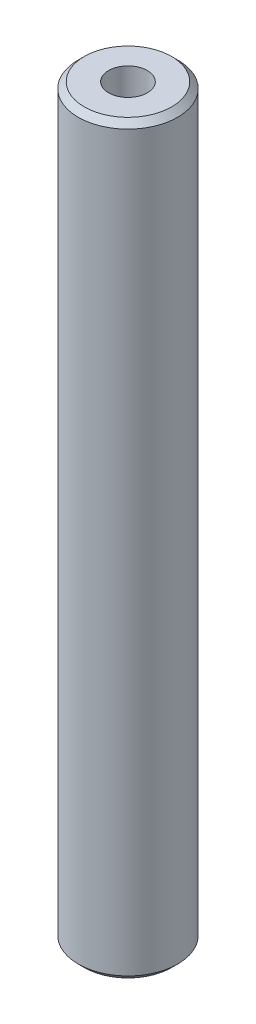
ISO-10303-21;
HEADER;
FILE_DESCRIPTION(('STEP AP214'),'2;1');
FILE_NAME('part.step','',(''),(''),'','','');
FILE_SCHEMA(('AUTOMOTIVE_DESIGN { 1 0 10303 214 1 1 1 1 }'));
ENDSEC;
DATA;
#1=APPLICATION_CONTEXT('core data for automotive mechanical design processes');
#2=APPLICATION_PROTOCOL_DEFINITION('international standard','automotive_design',2000,#1);
#3=PRODUCT_CONTEXT('',#1,'mechanical');
#4=PRODUCT('Part','Part','',(#3));
#5=PRODUCT_RELATED_PRODUCT_CATEGORY('part','',(#4));
#6=PRODUCT_DEFINITION_FORMATION('','',#4);
#7=PRODUCT_DEFINITION_CONTEXT('part definition',#1,'design');
#8=PRODUCT_DEFINITION('design','',#6,#7);
#9=PRODUCT_DEFINITION_SHAPE('','',#8);
#10=(LENGTH_UNIT() NAMED_UNIT(*) SI_UNIT(.MILLI.,.METRE.));
#11=(NAMED_UNIT(*) PLANE_ANGLE_UNIT() SI_UNIT($,.RADIAN.));
#12=(NAMED_UNIT(*) SI_UNIT($,.STERADIAN.) SOLID_ANGLE_UNIT());
#13=UNCERTAINTY_MEASURE_WITH_UNIT(LENGTH_MEASURE(1.E-05),#10,'distance_accuracy_value','');
#14=(GEOMETRIC_REPRESENTATION_CONTEXT(3) GLOBAL_UNCERTAINTY_ASSIGNED_CONTEXT((#13)) GLOBAL_UNIT_ASSIGNED_CONTEXT((#10,
#11,#12)) REPRESENTATION_CONTEXT('',''));
#15=CARTESIAN_POINT('',(0.,0.,0.));
#16=DIRECTION('',(0.,0.,1.));
#17=DIRECTION('',(1.,0.,0.));
#18=AXIS2_PLACEMENT_3D('',#15,#16,#17);
#19=CARTESIAN_POINT('',(0.,600.,0.));
#20=DIRECTION('',(0.,-1.,0.));
#21=DIRECTION('',(0.,0.,-1.));
#22=AXIS2_PLACEMENT_3D('',#19,#20,#21);
#23=CYLINDRICAL_SURFACE('',#22,40.);
#24=CARTESIAN_POINT('',(0.,595.168880387259,0.));
#25=DIRECTION('',(0.,1.,0.));
#26=DIRECTION('',(0.,0.,1.));
#27=AXIS2_PLACEMENT_3D('',#24,#25,#26);
#28=CIRCLE('',#27,40.);
#29=CARTESIAN_POINT('',(0.,595.168880387259,40.));
#30=VERTEX_POINT('',#29);
#31=EDGE_CURVE('E50',#30,#30,#28,.F.);
#32=ORIENTED_EDGE('',*,*,#31,.T.);
#33=EDGE_LOOP('',(#32));
#34=FACE_BOUND('',#33,.T.);
#35=CARTESIAN_POINT('',(0.,4.83111961274019,0.));
#36=DIRECTION('',(0.,1.,0.));
#37=DIRECTION('',(0.,0.,1.));
#38=AXIS2_PLACEMENT_3D('',#35,#36,#37);
#39=CIRCLE('',#38,40.);
#40=CARTESIAN_POINT('',(0.,4.83111961274019,40.));
#41=VERTEX_POINT('',#40);
#42=EDGE_CURVE('E51',#41,#41,#39,.T.);
#43=ORIENTED_EDGE('',*,*,#42,.T.);
#44=EDGE_LOOP('',(#43));
#45=FACE_BOUND('',#44,.T.);
#46=ADVANCED_FACE('F39',(#34,#45),#23,.T.);
#47=CARTESIAN_POINT('',(0.,600.,0.));
#48=DIRECTION('',(0.,1.,0.));
#49=DIRECTION('',(0.,0.,1.));
#50=AXIS2_PLACEMENT_3D('',#47,#48,#49);
#51=PLANE('',#50);
#52=CARTESIAN_POINT('',(0.,600.,0.));
#53=DIRECTION('',(0.,1.,0.));
#54=DIRECTION('',(0.,0.,1.));
#55=AXIS2_PLACEMENT_3D('',#52,#53,#54);
#56=CIRCLE('',#55,35.1688803872596);
#57=CARTESIAN_POINT('',(0.,600.,35.1688803872596));
#58=VERTEX_POINT('',#57);
#59=EDGE_CURVE('E54',#58,#58,#56,.T.);
#60=ORIENTED_EDGE('',*,*,#59,.T.);
#61=EDGE_LOOP('',(#60));
#62=FACE_BOUND('',#61,.T.);
#63=CARTESIAN_POINT('',(0.,600.,0.));
#64=DIRECTION('',(0.,1.,0.));
#65=DIRECTION('',(0.,0.,1.));
#66=AXIS2_PLACEMENT_3D('',#63,#64,#65);
#67=CIRCLE('',#66,15.5747831881664);
#68=CARTESIAN_POINT('',(0.,600.,15.5747831881664));
#69=VERTEX_POINT('',#68);
#70=EDGE_CURVE('E58',#69,#69,#67,.T.);
#71=ORIENTED_EDGE('',*,*,#70,.F.);
#72=EDGE_LOOP('',(#71));
#73=FACE_BOUND('',#72,.T.);
#74=ADVANCED_FACE('F69',(#62,#73),#51,.T.);
#75=CARTESIAN_POINT('',(0.,0.,0.));
#76=DIRECTION('',(0.,1.,0.));
#77=DIRECTION('',(0.,0.,1.));
#78=AXIS2_PLACEMENT_3D('',#75,#76,#77);
#79=PLANE('',#78);
#80=CARTESIAN_POINT('',(0.,0.,0.));
#81=DIRECTION('',(0.,1.,0.));
#82=DIRECTION('',(0.,0.,1.));
#83=AXIS2_PLACEMENT_3D('',#80,#81,#82);
#84=CIRCLE('',#83,35.1688803872598);
#85=CARTESIAN_POINT('',(0.,0.,35.1688803872598));
#86=VERTEX_POINT('',#85);
#87=EDGE_CURVE('E10',#86,#86,#84,.F.);
#88=ORIENTED_EDGE('',*,*,#87,.T.);
#89=EDGE_LOOP('',(#88));
#90=FACE_BOUND('',#89,.T.);
#91=CARTESIAN_POINT('',(0.,0.,0.));
#92=DIRECTION('',(0.,1.,0.));
#93=DIRECTION('',(0.,0.,1.));
#94=AXIS2_PLACEMENT_3D('',#91,#92,#93);
#95=CIRCLE('',#94,15.5747831881664);
#96=CARTESIAN_POINT('',(0.,0.,15.5747831881664));
#97=VERTEX_POINT('',#96);
#98=EDGE_CURVE('E63',#97,#97,#95,.T.);
#99=ORIENTED_EDGE('',*,*,#98,.T.);
#100=EDGE_LOOP('',(#99));
#101=FACE_BOUND('',#100,.T.);
#102=ADVANCED_FACE('F75',(#90,#101),#79,.F.);
#103=CARTESIAN_POINT('',(0.,600.,0.));
#104=DIRECTION('',(0.,-1.,0.));
#105=DIRECTION('',(0.,0.,-1.));
#106=AXIS2_PLACEMENT_3D('',#103,#104,#105);
#107=CYLINDRICAL_SURFACE('',#106,15.5747831881664);
#108=ORIENTED_EDGE('',*,*,#70,.T.);
#109=EDGE_LOOP('',(#108));
#110=FACE_BOUND('',#109,.T.);
#111=ORIENTED_EDGE('',*,*,#98,.F.);
#112=EDGE_LOOP('',(#111));
#113=FACE_BOUND('',#112,.T.);
#114=ADVANCED_FACE('F70',(#110,#113),#107,.F.);
#115=CARTESIAN_POINT('',(0.,600.,0.));
#116=DIRECTION('',(0.,-1.,0.));
#117=DIRECTION('',(0.,0.,-1.));
#118=AXIS2_PLACEMENT_3D('',#115,#116,#117);
#119=CONICAL_SURFACE('',#118,35.1688803872596,0.785398163397433);
#120=ORIENTED_EDGE('',*,*,#31,.F.);
#121=EDGE_LOOP('',(#120));
#122=FACE_BOUND('',#121,.T.);
#123=ORIENTED_EDGE('',*,*,#59,.F.);
#124=EDGE_LOOP('',(#123));
#125=FACE_BOUND('',#124,.T.);
#126=ADVANCED_FACE('F81',(#122,#125),#119,.T.);
#127=CARTESIAN_POINT('',(0.,4.83111961274019,0.));
#128=DIRECTION('',(0.,1.,0.));
#129=DIRECTION('',(0.,0.,1.));
#130=AXIS2_PLACEMENT_3D('',#127,#128,#129);
#131=CONICAL_SURFACE('',#130,40.,0.78539816339745);
#132=ORIENTED_EDGE('',*,*,#87,.F.);
#133=EDGE_LOOP('',(#132));
#134=FACE_BOUND('',#133,.T.);
#135=ORIENTED_EDGE('',*,*,#42,.F.);
#136=EDGE_LOOP('',(#135));
#137=FACE_BOUND('',#136,.T.);
#138=ADVANCED_FACE('F45',(#134,#137),#131,.T.);
#139=CLOSED_SHELL('',(#46,#74,#102,#114,#126,#138));
#140=MANIFOLD_SOLID_BREP('B2',#139);
#141=ADVANCED_BREP_SHAPE_REPRESENTATION('',(#18,#140),#14);
#142=SHAPE_DEFINITION_REPRESENTATION(#9,#141);
ENDSEC;
END-ISO-10303-21;
